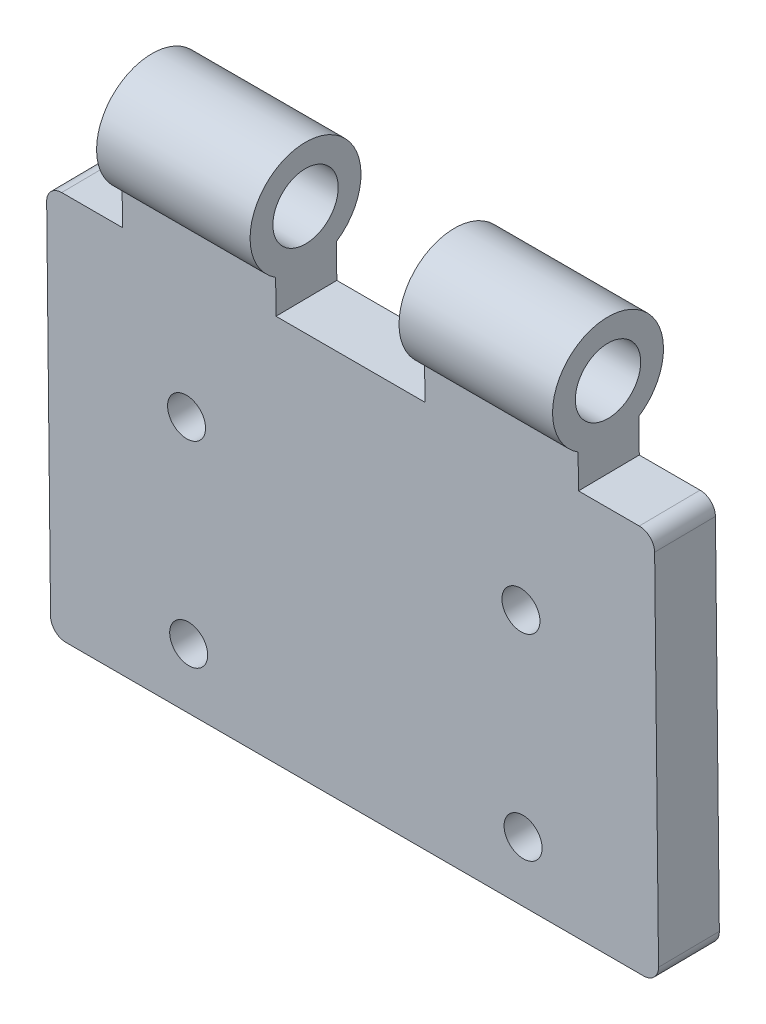
ISO-10303-21;
HEADER;
FILE_DESCRIPTION(('STEP AP214'),'2;1');
FILE_NAME('part.step','',(''),(''),'','','');
FILE_SCHEMA(('AUTOMOTIVE_DESIGN { 1 0 10303 214 1 1 1 1 }'));
ENDSEC;
DATA;
#1=APPLICATION_CONTEXT('core data for automotive mechanical design processes');
#2=APPLICATION_PROTOCOL_DEFINITION('international standard','automotive_design',2000,#1);
#3=PRODUCT_CONTEXT('',#1,'mechanical');
#4=PRODUCT('Part','Part','',(#3));
#5=PRODUCT_RELATED_PRODUCT_CATEGORY('part','',(#4));
#6=PRODUCT_DEFINITION_FORMATION('','',#4);
#7=PRODUCT_DEFINITION_CONTEXT('part definition',#1,'design');
#8=PRODUCT_DEFINITION('design','',#6,#7);
#9=PRODUCT_DEFINITION_SHAPE('','',#8);
#10=(LENGTH_UNIT() NAMED_UNIT(*) SI_UNIT(.MILLI.,.METRE.));
#11=(NAMED_UNIT(*) PLANE_ANGLE_UNIT() SI_UNIT($,.RADIAN.));
#12=(NAMED_UNIT(*) SI_UNIT($,.STERADIAN.) SOLID_ANGLE_UNIT());
#13=UNCERTAINTY_MEASURE_WITH_UNIT(LENGTH_MEASURE(1.E-05),#10,'distance_accuracy_value','');
#14=(GEOMETRIC_REPRESENTATION_CONTEXT(3) GLOBAL_UNCERTAINTY_ASSIGNED_CONTEXT((#13)) GLOBAL_UNIT_ASSIGNED_CONTEXT((#10,
#11,#12)) REPRESENTATION_CONTEXT('',''));
#15=CARTESIAN_POINT('',(0.,0.,0.));
#16=DIRECTION('',(0.,0.,1.));
#17=DIRECTION('',(1.,0.,0.));
#18=AXIS2_PLACEMENT_3D('',#15,#16,#17);
#19=CARTESIAN_POINT('',(40.,0.,0.));
#20=DIRECTION('',(1.,0.,0.));
#21=DIRECTION('',(0.,0.,-1.));
#22=AXIS2_PLACEMENT_3D('',#19,#20,#21);
#23=PLANE('',#22);
#24=DIRECTION('',(0.,0.999941927244883,0.0107769261753868));
#25=VECTOR('',#24,1.);
#26=CARTESIAN_POINT('',(40.,-3.03146842942826,-2.03290412006562));
#27=LINE('',#26,#25);
#28=CARTESIAN_POINT('',(40.,-30.0315265021834,-2.32389865150102));
#29=VERTEX_POINT('',#28);
#30=CARTESIAN_POINT('',(40.,-6.2568215382056,-2.06766553109938));
#31=VERTEX_POINT('',#30);
#32=EDGE_CURVE('E215',#29,#31,#27,.T.);
#33=ORIENTED_EDGE('',*,*,#32,.T.);
#34=DIRECTION('',(0.,-0.0107769261753868,0.999941927244883));
#35=VECTOR('',#34,1.);
#36=CARTESIAN_POINT('',(40.,-6.27837664232066,-0.0676655310993801));
#37=LINE('',#36,#35);
#38=CARTESIAN_POINT('',(40.,-6.29993174643571,1.93233446890062));
#39=VERTEX_POINT('',#38);
#40=EDGE_CURVE('E283',#31,#39,#37,.T.);
#41=ORIENTED_EDGE('',*,*,#40,.T.);
#42=DIRECTION('',(0.,-0.999941927244883,-0.0107769261753868));
#43=VECTOR('',#42,1.);
#44=CARTESIAN_POINT('',(40.,-3.07457863765837,1.96709587993438));
#45=LINE('',#44,#43);
#46=CARTESIAN_POINT('',(40.,-30.0746367104135,1.67610134849898));
#47=VERTEX_POINT('',#46);
#48=EDGE_CURVE('E212',#39,#47,#45,.T.);
#49=ORIENTED_EDGE('',*,*,#48,.T.);
#50=DIRECTION('',(0.,0.0107769261753876,-0.999941927244883));
#51=VECTOR('',#50,1.);
#52=CARTESIAN_POINT('',(40.,-30.0315265021834,-2.32389865150102));
#53=LINE('',#52,#51);
#54=EDGE_CURVE('E280',#47,#29,#53,.T.);
#55=ORIENTED_EDGE('',*,*,#54,.T.);
#56=EDGE_LOOP('',(#33,#41,#49,#55));
#57=FACE_BOUND('',#56,.T.);
#58=ADVANCED_FACE('F35',(#57),#23,.T.);
#59=CARTESIAN_POINT('',(40.,0.,0.));
#60=DIRECTION('',(-1.,0.,0.));
#61=DIRECTION('',(0.,0.,1.));
#62=AXIS2_PLACEMENT_3D('',#59,#60,#61);
#63=CYLINDRICAL_SURFACE('',#62,3.65);
#64=DIRECTION('',(-1.,0.,0.));
#65=VECTOR('',#64,1.);
#66=CARTESIAN_POINT('',(40.,-3.03146842942826,-2.03290412006562));
#67=LINE('',#66,#65);
#68=CARTESIAN_POINT('',(15.0999999999995,-3.03146842942826,-2.03290412006562));
#69=VERTEX_POINT('',#68);
#70=CARTESIAN_POINT('',(5.00000000000058,-3.03146842942826,-2.03290412006562));
#71=VERTEX_POINT('',#70);
#72=EDGE_CURVE('E219',#69,#71,#67,.T.);
#73=ORIENTED_EDGE('',*,*,#72,.T.);
#74=CARTESIAN_POINT('',(5.00000000000058,0.,0.));
#75=DIRECTION('',(1.,0.,0.));
#76=DIRECTION('',(0.,0.,-1.));
#77=AXIS2_PLACEMENT_3D('',#74,#75,#76);
#78=CIRCLE('',#77,3.65);
#79=CARTESIAN_POINT('',(5.00000000000058,-3.07457863765837,1.96709587993438));
#80=VERTEX_POINT('',#79);
#81=EDGE_CURVE('E182',#71,#80,#78,.T.);
#82=ORIENTED_EDGE('',*,*,#81,.T.);
#83=DIRECTION('',(-1.,0.,0.));
#84=VECTOR('',#83,1.);
#85=CARTESIAN_POINT('',(40.,-3.07457863765837,1.96709587993438));
#86=LINE('',#85,#84);
#87=CARTESIAN_POINT('',(15.0999999999995,-3.07457863765837,1.96709587993438));
#88=VERTEX_POINT('',#87);
#89=EDGE_CURVE('E232',#88,#80,#86,.T.);
#90=ORIENTED_EDGE('',*,*,#89,.F.);
#91=CARTESIAN_POINT('',(15.0999999999995,0.,0.));
#92=DIRECTION('',(1.,0.,0.));
#93=DIRECTION('',(0.,0.,-1.));
#94=AXIS2_PLACEMENT_3D('',#91,#92,#93);
#95=CIRCLE('',#94,3.65);
#96=EDGE_CURVE('E328',#69,#88,#95,.T.);
#97=ORIENTED_EDGE('',*,*,#96,.F.);
#98=EDGE_LOOP('',(#73,#82,#90,#97));
#99=FACE_BOUND('',#98,.T.);
#100=ADVANCED_FACE('F334',(#99),#63,.T.);
#101=CARTESIAN_POINT('',(34.9999999999994,-3.03146842942826,-2.03290412006562));
#102=VERTEX_POINT('',#101);
#103=CARTESIAN_POINT('',(24.9000000000005,-3.03146842942826,-2.03290412006562));
#104=VERTEX_POINT('',#103);
#105=EDGE_CURVE('E226',#102,#104,#67,.T.);
#106=ORIENTED_EDGE('',*,*,#105,.T.);
#107=CARTESIAN_POINT('',(24.9000000000005,0.,0.));
#108=DIRECTION('',(1.,0.,0.));
#109=DIRECTION('',(0.,0.,-1.));
#110=AXIS2_PLACEMENT_3D('',#107,#108,#109);
#111=CIRCLE('',#110,3.65);
#112=CARTESIAN_POINT('',(24.9000000000005,-3.07457863765837,1.96709587993438));
#113=VERTEX_POINT('',#112);
#114=EDGE_CURVE('E322',#104,#113,#111,.T.);
#115=ORIENTED_EDGE('',*,*,#114,.T.);
#116=CARTESIAN_POINT('',(34.9999999999994,-3.07457863765837,1.96709587993438));
#117=VERTEX_POINT('',#116);
#118=EDGE_CURVE('E235',#117,#113,#86,.T.);
#119=ORIENTED_EDGE('',*,*,#118,.F.);
#120=CARTESIAN_POINT('',(34.9999999999994,0.,0.));
#121=DIRECTION('',(1.,0.,0.));
#122=DIRECTION('',(0.,0.,-1.));
#123=AXIS2_PLACEMENT_3D('',#120,#121,#122);
#124=CIRCLE('',#123,3.65);
#125=EDGE_CURVE('E155',#102,#117,#124,.T.);
#126=ORIENTED_EDGE('',*,*,#125,.F.);
#127=EDGE_LOOP('',(#106,#115,#119,#126));
#128=FACE_BOUND('',#127,.T.);
#129=ADVANCED_FACE('F369',(#128),#63,.T.);
#130=CARTESIAN_POINT('',(40.,-3.07457863765837,1.96709587993438));
#131=DIRECTION('',(0.,0.0107769261753868,-0.999941927244883));
#132=DIRECTION('',(0.,0.999941927244883,0.0107769261753868));
#133=AXIS2_PLACEMENT_3D('',#130,#131,#132);
#134=PLANE('',#133);
#135=CARTESIAN_POINT('',(31.1201038631393,-14.0755658744954,1.84853216730516));
#136=DIRECTION('',(0.,0.0107769261753868,-0.999941927244883));
#137=DIRECTION('',(0.,0.999941927244883,0.0107769261753868));
#138=AXIS2_PLACEMENT_3D('',#135,#136,#137);
#139=CIRCLE('',#138,1.25);
#140=CARTESIAN_POINT('',(31.1201038631393,-12.8256384654393,1.8620033250244));
#141=VERTEX_POINT('',#140);
#142=EDGE_CURVE('E197',#141,#141,#139,.F.);
#143=ORIENTED_EDGE('',*,*,#142,.F.);
#144=EDGE_LOOP('',(#143));
#145=FACE_BOUND('',#144,.T.);
#146=CARTESIAN_POINT('',(9.12010386313934,-27.0748109286788,1.70843212702514));
#147=DIRECTION('',(0.,0.0107769261753868,-0.999941927244883));
#148=DIRECTION('',(0.,0.999941927244883,0.0107769261753868));
#149=AXIS2_PLACEMENT_3D('',#146,#147,#148);
#150=CIRCLE('',#149,1.25);
#151=CARTESIAN_POINT('',(9.12010386313934,-25.8248835196227,1.72190328474437));
#152=VERTEX_POINT('',#151);
#153=EDGE_CURVE('E198',#152,#152,#150,.F.);
#154=ORIENTED_EDGE('',*,*,#153,.F.);
#155=EDGE_LOOP('',(#154));
#156=FACE_BOUND('',#155,.T.);
#157=CARTESIAN_POINT('',(9.12010386313935,-14.0755658744954,1.84853216730516));
#158=DIRECTION('',(0.,0.0107769261753868,-0.999941927244883));
#159=DIRECTION('',(0.,0.999941927244883,0.0107769261753868));
#160=AXIS2_PLACEMENT_3D('',#157,#158,#159);
#161=CIRCLE('',#160,1.25);
#162=CARTESIAN_POINT('',(9.12010386313935,-12.8256384654393,1.8620033250244));
#163=VERTEX_POINT('',#162);
#164=EDGE_CURVE('E190',#163,#163,#161,.F.);
#165=ORIENTED_EDGE('',*,*,#164,.F.);
#166=EDGE_LOOP('',(#165));
#167=FACE_BOUND('',#166,.T.);
#168=CARTESIAN_POINT('',(31.1201038631393,-27.0748109286788,1.70843212702514));
#169=DIRECTION('',(0.,0.0107769261753868,-0.999941927244883));
#170=DIRECTION('',(0.,0.999941927244883,0.0107769261753868));
#171=AXIS2_PLACEMENT_3D('',#168,#169,#170);
#172=CIRCLE('',#171,1.25);
#173=CARTESIAN_POINT('',(31.1201038631393,-25.8248835196227,1.72190328474437));
#174=VERTEX_POINT('',#173);
#175=EDGE_CURVE('E208',#174,#174,#172,.F.);
#176=ORIENTED_EDGE('',*,*,#175,.F.);
#177=EDGE_LOOP('',(#176));
#178=FACE_BOUND('',#177,.T.);
#179=DIRECTION('',(-1.,0.,0.));
#180=VECTOR('',#179,1.);
#181=CARTESIAN_POINT('',(40.,-5.29998981919083,1.94311139507601));
#182=LINE('',#181,#180);
#183=CARTESIAN_POINT('',(5.00000000000058,-5.29998981919083,1.943111395076));
#184=VERTEX_POINT('',#183);
#185=CARTESIAN_POINT('',(1.,-5.29998981919083,1.94311139507601));
#186=VERTEX_POINT('',#185);
#187=EDGE_CURVE('E179',#184,#186,#182,.T.);
#188=ORIENTED_EDGE('',*,*,#187,.T.);
#189=CARTESIAN_POINT('',(1.,-6.29993174643571,1.93233446890062));
#190=DIRECTION('',(0.,0.0107769261753868,-0.999941927244883));
#191=DIRECTION('',(0.,0.999941927244883,0.0107769261753868));
#192=AXIS2_PLACEMENT_3D('',#189,#190,#191);
#193=CIRCLE('',#192,1.);
#194=CARTESIAN_POINT('',(0.,-6.29993174643571,1.93233446890062));
#195=VERTEX_POINT('',#194);
#196=EDGE_CURVE('E268',#186,#195,#193,.F.);
#197=ORIENTED_EDGE('',*,*,#196,.T.);
#198=DIRECTION('',(0.,-0.999941927244883,-0.0107769261753868));
#199=VECTOR('',#198,1.);
#200=CARTESIAN_POINT('',(0.,-3.07457863765837,1.96709587993438));
#201=LINE('',#200,#199);
#202=CARTESIAN_POINT('',(0.,-30.0746367104135,1.67610134849898));
#203=VERTEX_POINT('',#202);
#204=EDGE_CURVE('E211',#195,#203,#201,.T.);
#205=ORIENTED_EDGE('',*,*,#204,.T.);
#206=CARTESIAN_POINT('',(1.,-30.0746367104135,1.67610134849898));
#207=DIRECTION('',(0.,0.0107769261753868,-0.999941927244883));
#208=DIRECTION('',(0.,0.999941927244883,0.0107769261753868));
#209=AXIS2_PLACEMENT_3D('',#206,#207,#208);
#210=CIRCLE('',#209,1.);
#211=CARTESIAN_POINT('',(1.,-31.0745786376584,1.66532442232359));
#212=VERTEX_POINT('',#211);
#213=EDGE_CURVE('E263',#203,#212,#210,.F.);
#214=ORIENTED_EDGE('',*,*,#213,.T.);
#215=DIRECTION('',(-1.,0.,0.));
#216=VECTOR('',#215,1.);
#217=CARTESIAN_POINT('',(40.,-31.0745786376584,1.66532442232359));
#218=LINE('',#217,#216);
#219=CARTESIAN_POINT('',(39.,-31.0745786376584,1.66532442232359));
#220=VERTEX_POINT('',#219);
#221=EDGE_CURVE('E229',#220,#212,#218,.T.);
#222=ORIENTED_EDGE('',*,*,#221,.F.);
#223=CARTESIAN_POINT('',(39.,-30.0746367104135,1.67610134849898));
#224=DIRECTION('',(0.,0.0107769261753868,-0.999941927244883));
#225=DIRECTION('',(0.,0.999941927244883,0.0107769261753868));
#226=AXIS2_PLACEMENT_3D('',#223,#224,#225);
#227=CIRCLE('',#226,1.);
#228=EDGE_CURVE('E265',#220,#47,#227,.F.);
#229=ORIENTED_EDGE('',*,*,#228,.T.);
#230=ORIENTED_EDGE('',*,*,#48,.F.);
#231=CARTESIAN_POINT('',(39.,-6.29993174643571,1.93233446890062));
#232=DIRECTION('',(0.,0.0107769261753868,-0.999941927244883));
#233=DIRECTION('',(0.,0.999941927244883,0.0107769261753868));
#234=AXIS2_PLACEMENT_3D('',#231,#232,#233);
#235=CIRCLE('',#234,1.);
#236=CARTESIAN_POINT('',(39.,-5.29998981919083,1.94311139507601));
#237=VERTEX_POINT('',#236);
#238=EDGE_CURVE('E174',#39,#237,#235,.F.);
#239=ORIENTED_EDGE('',*,*,#238,.T.);
#240=DIRECTION('',(1.,0.,0.));
#241=VECTOR('',#240,1.);
#242=CARTESIAN_POINT('',(40.,-5.29998981919083,1.94311139507601));
#243=LINE('',#242,#241);
#244=CARTESIAN_POINT('',(34.9999999999994,-5.29998981919083,1.943111395076));
#245=VERTEX_POINT('',#244);
#246=EDGE_CURVE('E165',#245,#237,#243,.T.);
#247=ORIENTED_EDGE('',*,*,#246,.F.);
#248=DIRECTION('',(0.,-0.999941927244883,-0.0107769261753868));
#249=VECTOR('',#248,1.);
#250=CARTESIAN_POINT('',(34.9999999999994,-3.07457863765837,1.96709587993438));
#251=LINE('',#250,#249);
#252=EDGE_CURVE('E149',#117,#245,#251,.T.);
#253=ORIENTED_EDGE('',*,*,#252,.F.);
#254=ORIENTED_EDGE('',*,*,#118,.T.);
#255=DIRECTION('',(0.,-0.999941927244883,-0.0107769261753868));
#256=VECTOR('',#255,1.);
#257=CARTESIAN_POINT('',(24.9000000000005,-3.07457863765837,1.96709587993438));
#258=LINE('',#257,#256);
#259=CARTESIAN_POINT('',(24.9000000000005,-5.29998981919083,1.943111395076));
#260=VERTEX_POINT('',#259);
#261=EDGE_CURVE('E248',#113,#260,#258,.T.);
#262=ORIENTED_EDGE('',*,*,#261,.T.);
#263=DIRECTION('',(-1.,0.,0.));
#264=VECTOR('',#263,1.);
#265=CARTESIAN_POINT('',(40.,-5.29998981919083,1.94311139507601));
#266=LINE('',#265,#264);
#267=CARTESIAN_POINT('',(15.0999999999995,-5.29998981919083,1.943111395076));
#268=VERTEX_POINT('',#267);
#269=EDGE_CURVE('E175',#260,#268,#266,.T.);
#270=ORIENTED_EDGE('',*,*,#269,.T.);
#271=DIRECTION('',(0.,-0.999941927244883,-0.0107769261753868));
#272=VECTOR('',#271,1.);
#273=CARTESIAN_POINT('',(15.0999999999995,-3.07457863765837,1.96709587993438));
#274=LINE('',#273,#272);
#275=EDGE_CURVE('E253',#88,#268,#274,.T.);
#276=ORIENTED_EDGE('',*,*,#275,.F.);
#277=ORIENTED_EDGE('',*,*,#89,.T.);
#278=DIRECTION('',(0.,-0.999941927244883,-0.0107769261753868));
#279=VECTOR('',#278,1.);
#280=CARTESIAN_POINT('',(5.00000000000058,-3.07457863765837,1.96709587993438));
#281=LINE('',#280,#279);
#282=EDGE_CURVE('E176',#80,#184,#281,.T.);
#283=ORIENTED_EDGE('',*,*,#282,.T.);
#284=EDGE_LOOP('',(#188,#197,#205,#214,#222,#229,#230,#239,#247,#253,#254,#262,#270,#276,#277,#283));
#285=FACE_BOUND('',#284,.T.);
#286=ADVANCED_FACE('F172',(#145,#156,#167,#178,#285),#134,.F.);
#287=CARTESIAN_POINT('',(40.,-3.03146842942826,-2.03290412006562));
#288=DIRECTION('',(0.,-0.0107769261753868,0.999941927244883));
#289=DIRECTION('',(0.,-0.999941927244883,-0.0107769261753868));
#290=AXIS2_PLACEMENT_3D('',#287,#288,#289);
#291=PLANE('',#290);
#292=CARTESIAN_POINT('',(31.1201038631393,-14.0324556662653,-2.15146783269484));
#293=DIRECTION('',(0.,0.0107769261753868,-0.999941927244883));
#294=DIRECTION('',(0.,0.999941927244883,0.0107769261753868));
#295=AXIS2_PLACEMENT_3D('',#292,#293,#294);
#296=CIRCLE('',#295,1.25);
#297=CARTESIAN_POINT('',(31.1201038631393,-12.7825282572092,-2.1379966749756));
#298=VERTEX_POINT('',#297);
#299=EDGE_CURVE('E194',#298,#298,#296,.T.);
#300=ORIENTED_EDGE('',*,*,#299,.F.);
#301=EDGE_LOOP('',(#300));
#302=FACE_BOUND('',#301,.T.);
#303=CARTESIAN_POINT('',(9.12010386313934,-27.0317007204487,-2.29156787297486));
#304=DIRECTION('',(0.,0.0107769261753868,-0.999941927244883));
#305=DIRECTION('',(0.,-0.999941927244883,-0.0107769261753868));
#306=AXIS2_PLACEMENT_3D('',#303,#304,#305);
#307=CIRCLE('',#306,1.25);
#308=CARTESIAN_POINT('',(9.12010386313934,-28.2816281295048,-2.3050390306941));
#309=VERTEX_POINT('',#308);
#310=EDGE_CURVE('E193',#309,#309,#307,.T.);
#311=ORIENTED_EDGE('',*,*,#310,.F.);
#312=EDGE_LOOP('',(#311));
#313=FACE_BOUND('',#312,.T.);
#314=CARTESIAN_POINT('',(9.12010386313935,-14.0324556662653,-2.15146783269484));
#315=DIRECTION('',(0.,0.0107769261753868,-0.999941927244883));
#316=DIRECTION('',(0.,-0.999941927244883,-0.0107769261753868));
#317=AXIS2_PLACEMENT_3D('',#314,#315,#316);
#318=CIRCLE('',#317,1.25);
#319=CARTESIAN_POINT('',(9.12010386313935,-15.2823830753214,-2.16493899041407));
#320=VERTEX_POINT('',#319);
#321=EDGE_CURVE('E187',#320,#320,#318,.T.);
#322=ORIENTED_EDGE('',*,*,#321,.F.);
#323=EDGE_LOOP('',(#322));
#324=FACE_BOUND('',#323,.T.);
#325=CARTESIAN_POINT('',(31.1201038631393,-27.0317007204487,-2.29156787297486));
#326=DIRECTION('',(0.,0.0107769261753868,-0.999941927244883));
#327=DIRECTION('',(0.,0.999941927244883,0.0107769261753868));
#328=AXIS2_PLACEMENT_3D('',#325,#326,#327);
#329=CIRCLE('',#328,1.25);
#330=CARTESIAN_POINT('',(31.1201038631393,-25.7817733113926,-2.27809671525563));
#331=VERTEX_POINT('',#330);
#332=EDGE_CURVE('E201',#331,#331,#329,.T.);
#333=ORIENTED_EDGE('',*,*,#332,.F.);
#334=EDGE_LOOP('',(#333));
#335=FACE_BOUND('',#334,.T.);
#336=DIRECTION('',(0.,0.999941927244883,0.0107769261753868));
#337=VECTOR('',#336,1.);
#338=CARTESIAN_POINT('',(0.,-3.03146842942826,-2.03290412006562));
#339=LINE('',#338,#337);
#340=CARTESIAN_POINT('',(0.,-30.0315265021834,-2.32389865150102));
#341=VERTEX_POINT('',#340);
#342=CARTESIAN_POINT('',(0.,-6.2568215382056,-2.06766553109938));
#343=VERTEX_POINT('',#342);
#344=EDGE_CURVE('E216',#341,#343,#339,.T.);
#345=ORIENTED_EDGE('',*,*,#344,.T.);
#346=CARTESIAN_POINT('',(1.,-6.2568215382056,-2.06766553109938));
#347=DIRECTION('',(0.,-0.0107769261753868,0.999941927244883));
#348=DIRECTION('',(0.,-0.999941927244883,-0.0107769261753868));
#349=AXIS2_PLACEMENT_3D('',#346,#347,#348);
#350=CIRCLE('',#349,1.);
#351=CARTESIAN_POINT('',(1.,-5.25687961096072,-2.05688860492399));
#352=VERTEX_POINT('',#351);
#353=EDGE_CURVE('E278',#343,#352,#350,.F.);
#354=ORIENTED_EDGE('',*,*,#353,.T.);
#355=DIRECTION('',(1.,0.,0.));
#356=VECTOR('',#355,1.);
#357=CARTESIAN_POINT('',(40.,-5.25687961096072,-2.05688860492399));
#358=LINE('',#357,#356);
#359=CARTESIAN_POINT('',(5.00000000000058,-5.25687961096072,-2.05688860492399));
#360=VERTEX_POINT('',#359);
#361=EDGE_CURVE('E258',#352,#360,#358,.T.);
#362=ORIENTED_EDGE('',*,*,#361,.T.);
#363=DIRECTION('',(0.,0.999941927244883,0.0107769261753868));
#364=VECTOR('',#363,1.);
#365=CARTESIAN_POINT('',(5.00000000000058,-3.03146842942826,-2.03290412006562));
#366=LINE('',#365,#364);
#367=EDGE_CURVE('E252',#360,#71,#366,.T.);
#368=ORIENTED_EDGE('',*,*,#367,.T.);
#369=ORIENTED_EDGE('',*,*,#72,.F.);
#370=DIRECTION('',(0.,0.999941927244883,0.0107769261753868));
#371=VECTOR('',#370,1.);
#372=CARTESIAN_POINT('',(15.0999999999995,-3.03146842942826,-2.03290412006562));
#373=LINE('',#372,#371);
#374=CARTESIAN_POINT('',(15.0999999999995,-5.25687961096072,-2.05688860492399));
#375=VERTEX_POINT('',#374);
#376=EDGE_CURVE('E247',#375,#69,#373,.T.);
#377=ORIENTED_EDGE('',*,*,#376,.F.);
#378=DIRECTION('',(1.,0.,0.));
#379=VECTOR('',#378,1.);
#380=CARTESIAN_POINT('',(40.,-5.25687961096072,-2.05688860492399));
#381=LINE('',#380,#379);
#382=CARTESIAN_POINT('',(24.9000000000005,-5.25687961096072,-2.05688860492399));
#383=VERTEX_POINT('',#382);
#384=EDGE_CURVE('E255',#375,#383,#381,.T.);
#385=ORIENTED_EDGE('',*,*,#384,.T.);
#386=DIRECTION('',(0.,0.999941927244883,0.0107769261753868));
#387=VECTOR('',#386,1.);
#388=CARTESIAN_POINT('',(24.9000000000005,-3.03146842942826,-2.03290412006562));
#389=LINE('',#388,#387);
#390=EDGE_CURVE('E243',#383,#104,#389,.T.);
#391=ORIENTED_EDGE('',*,*,#390,.T.);
#392=ORIENTED_EDGE('',*,*,#105,.F.);
#393=DIRECTION('',(0.,0.999941927244883,0.0107769261753868));
#394=VECTOR('',#393,1.);
#395=CARTESIAN_POINT('',(34.9999999999994,-3.03146842942826,-2.03290412006562));
#396=LINE('',#395,#394);
#397=CARTESIAN_POINT('',(34.9999999999994,-5.25687961096072,-2.05688860492399));
#398=VERTEX_POINT('',#397);
#399=EDGE_CURVE('E239',#398,#102,#396,.T.);
#400=ORIENTED_EDGE('',*,*,#399,.F.);
#401=DIRECTION('',(-1.,0.,0.));
#402=VECTOR('',#401,1.);
#403=CARTESIAN_POINT('',(40.,-5.25687961096072,-2.05688860492399));
#404=LINE('',#403,#402);
#405=CARTESIAN_POINT('',(39.,-5.25687961096072,-2.05688860492399));
#406=VERTEX_POINT('',#405);
#407=EDGE_CURVE('E168',#406,#398,#404,.T.);
#408=ORIENTED_EDGE('',*,*,#407,.F.);
#409=CARTESIAN_POINT('',(39.,-6.2568215382056,-2.06766553109938));
#410=DIRECTION('',(0.,-0.0107769261753868,0.999941927244883));
#411=DIRECTION('',(0.,-0.999941927244883,-0.0107769261753868));
#412=AXIS2_PLACEMENT_3D('',#409,#410,#411);
#413=CIRCLE('',#412,1.);
#414=EDGE_CURVE('E276',#406,#31,#413,.F.);
#415=ORIENTED_EDGE('',*,*,#414,.T.);
#416=ORIENTED_EDGE('',*,*,#32,.F.);
#417=CARTESIAN_POINT('',(39.,-30.0315265021834,-2.32389865150102));
#418=DIRECTION('',(0.,-0.0107769261753868,0.999941927244883));
#419=DIRECTION('',(0.,-0.999941927244883,-0.0107769261753868));
#420=AXIS2_PLACEMENT_3D('',#417,#418,#419);
#421=CIRCLE('',#420,1.);
#422=CARTESIAN_POINT('',(39.,-31.0314684294283,-2.33467557767641));
#423=VERTEX_POINT('',#422);
#424=EDGE_CURVE('E58',#29,#423,#421,.F.);
#425=ORIENTED_EDGE('',*,*,#424,.T.);
#426=DIRECTION('',(-1.,0.,0.));
#427=VECTOR('',#426,1.);
#428=CARTESIAN_POINT('',(40.,-31.0314684294283,-2.33467557767641));
#429=LINE('',#428,#427);
#430=CARTESIAN_POINT('',(1.,-31.0314684294283,-2.33467557767641));
#431=VERTEX_POINT('',#430);
#432=EDGE_CURVE('E227',#423,#431,#429,.T.);
#433=ORIENTED_EDGE('',*,*,#432,.T.);
#434=CARTESIAN_POINT('',(1.,-30.0315265021834,-2.32389865150102));
#435=DIRECTION('',(0.,-0.0107769261753868,0.999941927244883));
#436=DIRECTION('',(0.,-0.999941927244883,-0.0107769261753868));
#437=AXIS2_PLACEMENT_3D('',#434,#435,#436);
#438=CIRCLE('',#437,1.);
#439=EDGE_CURVE('E50',#431,#341,#438,.F.);
#440=ORIENTED_EDGE('',*,*,#439,.T.);
#441=EDGE_LOOP('',(#345,#354,#362,#368,#369,#377,#385,#391,#392,#400,#408,#415,#416,#425,#433,#440));
#442=FACE_BOUND('',#441,.T.);
#443=ADVANCED_FACE('F292',(#302,#313,#324,#335,#442),#291,.F.);
#444=CARTESIAN_POINT('',(0.,0.,0.));
#445=DIRECTION('',(1.,0.,0.));
#446=DIRECTION('',(0.,0.,-1.));
#447=AXIS2_PLACEMENT_3D('',#444,#445,#446);
#448=PLANE('',#447);
#449=ORIENTED_EDGE('',*,*,#204,.F.);
#450=DIRECTION('',(0.,-0.0107769261753868,0.999941927244883));
#451=VECTOR('',#450,1.);
#452=CARTESIAN_POINT('',(0.,-6.27837664232066,-0.0676655310993801));
#453=LINE('',#452,#451);
#454=EDGE_CURVE('E272',#195,#343,#453,.F.);
#455=ORIENTED_EDGE('',*,*,#454,.T.);
#456=ORIENTED_EDGE('',*,*,#344,.F.);
#457=DIRECTION('',(0.,0.0107769261753876,-0.999941927244883));
#458=VECTOR('',#457,1.);
#459=CARTESIAN_POINT('',(0.,-30.0530816062984,-0.32389865150105));
#460=LINE('',#459,#458);
#461=EDGE_CURVE('E270',#341,#203,#460,.F.);
#462=ORIENTED_EDGE('',*,*,#461,.T.);
#463=EDGE_LOOP('',(#449,#455,#456,#462));
#464=FACE_BOUND('',#463,.T.);
#465=ADVANCED_FACE('F297',(#464),#448,.F.);
#466=CARTESIAN_POINT('',(40.,-31.0745786376584,1.66532442232359));
#467=DIRECTION('',(0.,0.999941927244883,0.0107769261753876));
#468=DIRECTION('',(0.,-0.0107769261753876,0.999941927244883));
#469=AXIS2_PLACEMENT_3D('',#466,#467,#468);
#470=PLANE('',#469);
#471=ORIENTED_EDGE('',*,*,#432,.F.);
#472=DIRECTION('',(0.,0.0107769261753876,-0.999941927244883));
#473=VECTOR('',#472,1.);
#474=CARTESIAN_POINT('',(39.,-31.0745786376584,1.66532442232359));
#475=LINE('',#474,#473);
#476=EDGE_CURVE('E11',#423,#220,#475,.F.);
#477=ORIENTED_EDGE('',*,*,#476,.T.);
#478=ORIENTED_EDGE('',*,*,#221,.T.);
#479=DIRECTION('',(0.,0.0107769261753876,-0.999941927244883));
#480=VECTOR('',#479,1.);
#481=CARTESIAN_POINT('',(1.,-31.0745786376584,1.66532442232359));
#482=LINE('',#481,#480);
#483=EDGE_CURVE('E43',#212,#431,#482,.T.);
#484=ORIENTED_EDGE('',*,*,#483,.T.);
#485=EDGE_LOOP('',(#471,#477,#478,#484));
#486=FACE_BOUND('',#485,.T.);
#487=ADVANCED_FACE('F288',(#486),#470,.F.);
#488=CARTESIAN_POINT('',(31.1201038631393,-27.1129131165737,5.24376071476315));
#489=DIRECTION('',(0.,0.0107769261753868,-0.999941927244883));
#490=DIRECTION('',(0.,0.999941927244883,0.0107769261753868));
#491=AXIS2_PLACEMENT_3D('',#488,#489,#490);
#492=CYLINDRICAL_SURFACE('',#491,1.25);
#493=ORIENTED_EDGE('',*,*,#175,.T.);
#494=EDGE_LOOP('',(#493));
#495=FACE_BOUND('',#494,.T.);
#496=ORIENTED_EDGE('',*,*,#332,.T.);
#497=EDGE_LOOP('',(#496));
#498=FACE_BOUND('',#497,.T.);
#499=ADVANCED_FACE('F380',(#495,#498),#492,.F.);
#500=CARTESIAN_POINT('',(9.12010386313935,-14.1136680623902,5.38386075504318));
#501=DIRECTION('',(0.,0.0107769261753868,-0.999941927244883));
#502=DIRECTION('',(0.,0.999941927244883,0.0107769261753868));
#503=AXIS2_PLACEMENT_3D('',#500,#501,#502);
#504=CYLINDRICAL_SURFACE('',#503,1.25);
#505=ORIENTED_EDGE('',*,*,#164,.T.);
#506=EDGE_LOOP('',(#505));
#507=FACE_BOUND('',#506,.T.);
#508=ORIENTED_EDGE('',*,*,#321,.T.);
#509=EDGE_LOOP('',(#508));
#510=FACE_BOUND('',#509,.T.);
#511=ADVANCED_FACE('F418',(#507,#510),#504,.F.);
#512=CARTESIAN_POINT('',(9.12010386313934,-27.1129131165737,5.24376071476315));
#513=DIRECTION('',(0.,0.0107769261753868,-0.999941927244883));
#514=DIRECTION('',(0.,0.999941927244883,0.0107769261753868));
#515=AXIS2_PLACEMENT_3D('',#512,#513,#514);
#516=CYLINDRICAL_SURFACE('',#515,1.25);
#517=ORIENTED_EDGE('',*,*,#153,.T.);
#518=EDGE_LOOP('',(#517));
#519=FACE_BOUND('',#518,.T.);
#520=ORIENTED_EDGE('',*,*,#310,.T.);
#521=EDGE_LOOP('',(#520));
#522=FACE_BOUND('',#521,.T.);
#523=ADVANCED_FACE('F421',(#519,#522),#516,.F.);
#524=CARTESIAN_POINT('',(31.1201038631393,-14.1136680623902,5.38386075504318));
#525=DIRECTION('',(0.,0.0107769261753868,-0.999941927244883));
#526=DIRECTION('',(0.,0.999941927244883,0.0107769261753868));
#527=AXIS2_PLACEMENT_3D('',#524,#525,#526);
#528=CYLINDRICAL_SURFACE('',#527,1.25);
#529=ORIENTED_EDGE('',*,*,#142,.T.);
#530=EDGE_LOOP('',(#529));
#531=FACE_BOUND('',#530,.T.);
#532=ORIENTED_EDGE('',*,*,#299,.T.);
#533=EDGE_LOOP('',(#532));
#534=FACE_BOUND('',#533,.T.);
#535=ADVANCED_FACE('F414',(#531,#534),#528,.F.);
#536=CARTESIAN_POINT('',(40.,-5.18144363126157,-9.05624980461764));
#537=DIRECTION('',(0.,0.999941927244883,0.0107769261753868));
#538=DIRECTION('',(0.,-0.0107769261753868,0.999941927244883));
#539=AXIS2_PLACEMENT_3D('',#536,#537,#538);
#540=PLANE('',#539);
#541=ORIENTED_EDGE('',*,*,#246,.T.);
#542=DIRECTION('',(0.,-0.0107769261753868,0.999941927244883));
#543=VECTOR('',#542,1.);
#544=CARTESIAN_POINT('',(39.,-5.18144363126157,-9.05624980461764));
#545=LINE('',#544,#543);
#546=EDGE_CURVE('E286',#237,#406,#545,.F.);
#547=ORIENTED_EDGE('',*,*,#546,.T.);
#548=ORIENTED_EDGE('',*,*,#407,.T.);
#549=DIRECTION('',(0.,-0.0107769261753868,0.999941927244883));
#550=VECTOR('',#549,1.);
#551=CARTESIAN_POINT('',(34.9999999999994,-5.18144363126158,-9.05624980461764));
#552=LINE('',#551,#550);
#553=EDGE_CURVE('E152',#398,#245,#552,.T.);
#554=ORIENTED_EDGE('',*,*,#553,.T.);
#555=EDGE_LOOP('',(#541,#547,#548,#554));
#556=FACE_BOUND('',#555,.T.);
#557=ADVANCED_FACE('F164',(#556),#540,.T.);
#558=CARTESIAN_POINT('',(34.9999999999994,-5.18144363126158,-9.05624980461764));
#559=DIRECTION('',(1.,0.,0.));
#560=DIRECTION('',(0.,0.,-1.));
#561=AXIS2_PLACEMENT_3D('',#558,#559,#560);
#562=PLANE('',#561);
#563=CARTESIAN_POINT('',(34.9999999999994,0.,0.));
#564=DIRECTION('',(1.,0.,0.));
#565=DIRECTION('',(0.,0.,-1.));
#566=AXIS2_PLACEMENT_3D('',#563,#564,#565);
#567=CIRCLE('',#566,2.15);
#568=CARTESIAN_POINT('',(34.9999999999994,0.,-2.15));
#569=VERTEX_POINT('',#568);
#570=EDGE_CURVE('E236',#569,#569,#567,.T.);
#571=ORIENTED_EDGE('',*,*,#570,.F.);
#572=EDGE_LOOP('',(#571));
#573=FACE_BOUND('',#572,.T.);
#574=ORIENTED_EDGE('',*,*,#252,.T.);
#575=ORIENTED_EDGE('',*,*,#553,.F.);
#576=ORIENTED_EDGE('',*,*,#399,.T.);
#577=ORIENTED_EDGE('',*,*,#125,.T.);
#578=EDGE_LOOP('',(#574,#575,#576,#577));
#579=FACE_BOUND('',#578,.T.);
#580=ADVANCED_FACE('F151',(#573,#579),#562,.T.);
#581=CARTESIAN_POINT('',(15.0999999999995,-5.18144363126157,-9.05624980461764));
#582=DIRECTION('',(0.,-0.999941927244883,-0.0107769261753868));
#583=DIRECTION('',(0.,0.0107769261753868,-0.999941927244883));
#584=AXIS2_PLACEMENT_3D('',#581,#582,#583);
#585=PLANE('',#584);
#586=DIRECTION('',(0.,-0.0107769261753868,0.999941927244883));
#587=VECTOR('',#586,1.);
#588=CARTESIAN_POINT('',(24.9000000000005,-5.18144363126157,-9.05624980461764));
#589=LINE('',#588,#587);
#590=EDGE_CURVE('E311',#383,#260,#589,.T.);
#591=ORIENTED_EDGE('',*,*,#590,.F.);
#592=ORIENTED_EDGE('',*,*,#384,.F.);
#593=DIRECTION('',(0.,-0.0107769261753868,0.999941927244883));
#594=VECTOR('',#593,1.);
#595=CARTESIAN_POINT('',(15.0999999999995,-5.18144363126157,-9.05624980461764));
#596=LINE('',#595,#594);
#597=EDGE_CURVE('E169',#375,#268,#596,.T.);
#598=ORIENTED_EDGE('',*,*,#597,.T.);
#599=ORIENTED_EDGE('',*,*,#269,.F.);
#600=EDGE_LOOP('',(#591,#592,#598,#599));
#601=FACE_BOUND('',#600,.T.);
#602=ADVANCED_FACE('F344',(#601),#585,.F.);
#603=CARTESIAN_POINT('',(15.0999999999995,-5.18144363126157,-9.05624980461764));
#604=DIRECTION('',(1.,0.,0.));
#605=DIRECTION('',(0.,0.,-1.));
#606=AXIS2_PLACEMENT_3D('',#603,#604,#605);
#607=PLANE('',#606);
#608=CARTESIAN_POINT('',(15.0999999999995,0.,0.));
#609=DIRECTION('',(1.,0.,0.));
#610=DIRECTION('',(0.,0.,-1.));
#611=AXIS2_PLACEMENT_3D('',#608,#609,#610);
#612=CIRCLE('',#611,2.15);
#613=CARTESIAN_POINT('',(15.0999999999995,0.,-2.15));
#614=VERTEX_POINT('',#613);
#615=EDGE_CURVE('E244',#614,#614,#612,.T.);
#616=ORIENTED_EDGE('',*,*,#615,.F.);
#617=EDGE_LOOP('',(#616));
#618=FACE_BOUND('',#617,.T.);
#619=ORIENTED_EDGE('',*,*,#275,.T.);
#620=ORIENTED_EDGE('',*,*,#597,.F.);
#621=ORIENTED_EDGE('',*,*,#376,.T.);
#622=ORIENTED_EDGE('',*,*,#96,.T.);
#623=EDGE_LOOP('',(#619,#620,#621,#622));
#624=FACE_BOUND('',#623,.T.);
#625=ADVANCED_FACE('F340',(#618,#624),#607,.T.);
#626=CARTESIAN_POINT('',(24.9000000000005,-5.18144363126157,-9.05624980461764));
#627=DIRECTION('',(1.,0.,0.));
#628=DIRECTION('',(0.,0.,-1.));
#629=AXIS2_PLACEMENT_3D('',#626,#627,#628);
#630=PLANE('',#629);
#631=CARTESIAN_POINT('',(24.9000000000005,0.,0.));
#632=DIRECTION('',(1.,0.,0.));
#633=DIRECTION('',(0.,0.,-1.));
#634=AXIS2_PLACEMENT_3D('',#631,#632,#633);
#635=CIRCLE('',#634,2.15);
#636=CARTESIAN_POINT('',(24.9000000000005,0.,-2.15));
#637=VERTEX_POINT('',#636);
#638=EDGE_CURVE('E160',#637,#637,#635,.T.);
#639=ORIENTED_EDGE('',*,*,#638,.T.);
#640=EDGE_LOOP('',(#639));
#641=FACE_BOUND('',#640,.T.);
#642=ORIENTED_EDGE('',*,*,#114,.F.);
#643=ORIENTED_EDGE('',*,*,#390,.F.);
#644=ORIENTED_EDGE('',*,*,#590,.T.);
#645=ORIENTED_EDGE('',*,*,#261,.F.);
#646=EDGE_LOOP('',(#642,#643,#644,#645));
#647=FACE_BOUND('',#646,.T.);
#648=ADVANCED_FACE('F399',(#641,#647),#630,.F.);
#649=CARTESIAN_POINT('',(40.,0.,0.));
#650=DIRECTION('',(-1.,0.,0.));
#651=DIRECTION('',(0.,0.,1.));
#652=AXIS2_PLACEMENT_3D('',#649,#650,#651);
#653=CYLINDRICAL_SURFACE('',#652,2.15);
#654=CARTESIAN_POINT('',(5.00000000000058,0.,0.));
#655=DIRECTION('',(1.,0.,0.));
#656=DIRECTION('',(0.,0.,-1.));
#657=AXIS2_PLACEMENT_3D('',#654,#655,#656);
#658=CIRCLE('',#657,2.15);
#659=CARTESIAN_POINT('',(5.00000000000058,0.,-2.15));
#660=VERTEX_POINT('',#659);
#661=EDGE_CURVE('E249',#660,#660,#658,.T.);
#662=ORIENTED_EDGE('',*,*,#661,.F.);
#663=EDGE_LOOP('',(#662));
#664=FACE_BOUND('',#663,.T.);
#665=ORIENTED_EDGE('',*,*,#615,.T.);
#666=EDGE_LOOP('',(#665));
#667=FACE_BOUND('',#666,.T.);
#668=ADVANCED_FACE('F358',(#664,#667),#653,.F.);
#669=CARTESIAN_POINT('',(0.,-5.18144363126157,-9.05624980461764));
#670=DIRECTION('',(0.,-0.999941927244883,-0.0107769261753868));
#671=DIRECTION('',(0.,0.0107769261753868,-0.999941927244883));
#672=AXIS2_PLACEMENT_3D('',#669,#670,#671);
#673=PLANE('',#672);
#674=ORIENTED_EDGE('',*,*,#361,.F.);
#675=DIRECTION('',(0.,-0.0107769261753868,0.999941927244883));
#676=VECTOR('',#675,1.);
#677=CARTESIAN_POINT('',(1.,-5.18144363126157,-9.05624980461764));
#678=LINE('',#677,#676);
#679=EDGE_CURVE('E260',#352,#186,#678,.T.);
#680=ORIENTED_EDGE('',*,*,#679,.T.);
#681=ORIENTED_EDGE('',*,*,#187,.F.);
#682=DIRECTION('',(0.,-0.0107769261753868,0.999941927244883));
#683=VECTOR('',#682,1.);
#684=CARTESIAN_POINT('',(5.00000000000058,-5.18144363126157,-9.05624980461764));
#685=LINE('',#684,#683);
#686=EDGE_CURVE('E240',#360,#184,#685,.T.);
#687=ORIENTED_EDGE('',*,*,#686,.F.);
#688=EDGE_LOOP('',(#674,#680,#681,#687));
#689=FACE_BOUND('',#688,.T.);
#690=ADVANCED_FACE('F308',(#689),#673,.F.);
#691=CARTESIAN_POINT('',(5.00000000000058,-5.18144363126157,-9.05624980461764));
#692=DIRECTION('',(1.,0.,0.));
#693=DIRECTION('',(0.,0.,-1.));
#694=AXIS2_PLACEMENT_3D('',#691,#692,#693);
#695=PLANE('',#694);
#696=ORIENTED_EDGE('',*,*,#661,.T.);
#697=EDGE_LOOP('',(#696));
#698=FACE_BOUND('',#697,.T.);
#699=ORIENTED_EDGE('',*,*,#81,.F.);
#700=ORIENTED_EDGE('',*,*,#367,.F.);
#701=ORIENTED_EDGE('',*,*,#686,.T.);
#702=ORIENTED_EDGE('',*,*,#282,.F.);
#703=EDGE_LOOP('',(#699,#700,#701,#702));
#704=FACE_BOUND('',#703,.T.);
#705=ADVANCED_FACE('F347',(#698,#704),#695,.F.);
#706=ORIENTED_EDGE('',*,*,#638,.F.);
#707=EDGE_LOOP('',(#706));
#708=FACE_BOUND('',#707,.T.);
#709=ORIENTED_EDGE('',*,*,#570,.T.);
#710=EDGE_LOOP('',(#709));
#711=FACE_BOUND('',#710,.T.);
#712=ADVANCED_FACE('F349',(#708,#711),#653,.F.);
#713=CARTESIAN_POINT('',(1.,-6.18138555850646,-9.06702673079303));
#714=DIRECTION('',(0.,-0.0107769261753868,0.999941927244883));
#715=DIRECTION('',(0.,-0.999941927244883,-0.0107769261753868));
#716=AXIS2_PLACEMENT_3D('',#713,#714,#715);
#717=CYLINDRICAL_SURFACE('',#716,1.);
#718=ORIENTED_EDGE('',*,*,#353,.F.);
#719=ORIENTED_EDGE('',*,*,#454,.F.);
#720=ORIENTED_EDGE('',*,*,#196,.F.);
#721=ORIENTED_EDGE('',*,*,#679,.F.);
#722=EDGE_LOOP('',(#718,#719,#720,#721));
#723=FACE_BOUND('',#722,.T.);
#724=ADVANCED_FACE('F301',(#723),#717,.T.);
#725=CARTESIAN_POINT('',(39.,-6.27837664232066,-0.0676655310993801));
#726=DIRECTION('',(0.,-0.0107769261753868,0.999941927244883));
#727=DIRECTION('',(0.,-0.999941927244883,-0.0107769261753868));
#728=AXIS2_PLACEMENT_3D('',#725,#726,#727);
#729=CYLINDRICAL_SURFACE('',#728,1.);
#730=ORIENTED_EDGE('',*,*,#414,.F.);
#731=ORIENTED_EDGE('',*,*,#546,.F.);
#732=ORIENTED_EDGE('',*,*,#238,.F.);
#733=ORIENTED_EDGE('',*,*,#40,.F.);
#734=EDGE_LOOP('',(#730,#731,#732,#733));
#735=FACE_BOUND('',#734,.T.);
#736=ADVANCED_FACE('F385',(#735),#729,.T.);
#737=CARTESIAN_POINT('',(39.,-30.0530816062984,-0.32389865150105));
#738=DIRECTION('',(0.,-0.0107769261753876,0.999941927244883));
#739=DIRECTION('',(0.,-0.999941927244883,-0.0107769261753876));
#740=AXIS2_PLACEMENT_3D('',#737,#738,#739);
#741=CYLINDRICAL_SURFACE('',#740,1.);
#742=ORIENTED_EDGE('',*,*,#228,.F.);
#743=ORIENTED_EDGE('',*,*,#476,.F.);
#744=ORIENTED_EDGE('',*,*,#424,.F.);
#745=ORIENTED_EDGE('',*,*,#54,.F.);
#746=EDGE_LOOP('',(#742,#743,#744,#745));
#747=FACE_BOUND('',#746,.T.);
#748=ADVANCED_FACE('F387',(#747),#741,.T.);
#749=CARTESIAN_POINT('',(1.,-30.0746367104135,1.67610134849898));
#750=DIRECTION('',(0.,0.0107769261753876,-0.999941927244883));
#751=DIRECTION('',(0.,0.999941927244883,0.0107769261753876));
#752=AXIS2_PLACEMENT_3D('',#749,#750,#751);
#753=CYLINDRICAL_SURFACE('',#752,1.);
#754=ORIENTED_EDGE('',*,*,#213,.F.);
#755=ORIENTED_EDGE('',*,*,#461,.F.);
#756=ORIENTED_EDGE('',*,*,#439,.F.);
#757=ORIENTED_EDGE('',*,*,#483,.F.);
#758=EDGE_LOOP('',(#754,#755,#756,#757));
#759=FACE_BOUND('',#758,.T.);
#760=ADVANCED_FACE('F37',(#759),#753,.T.);
#761=CLOSED_SHELL('',(#58,#100,#129,#286,#443,#465,#487,#499,#511,#523,#535,#557,#580,#602,#625,
#648,#668,#690,#705,#712,#724,#736,#748,#760));
#762=MANIFOLD_SOLID_BREP('B2',#761);
#763=ADVANCED_BREP_SHAPE_REPRESENTATION('',(#18,#762),#14);
#764=SHAPE_DEFINITION_REPRESENTATION(#9,#763);
ENDSEC;
END-ISO-10303-21;
